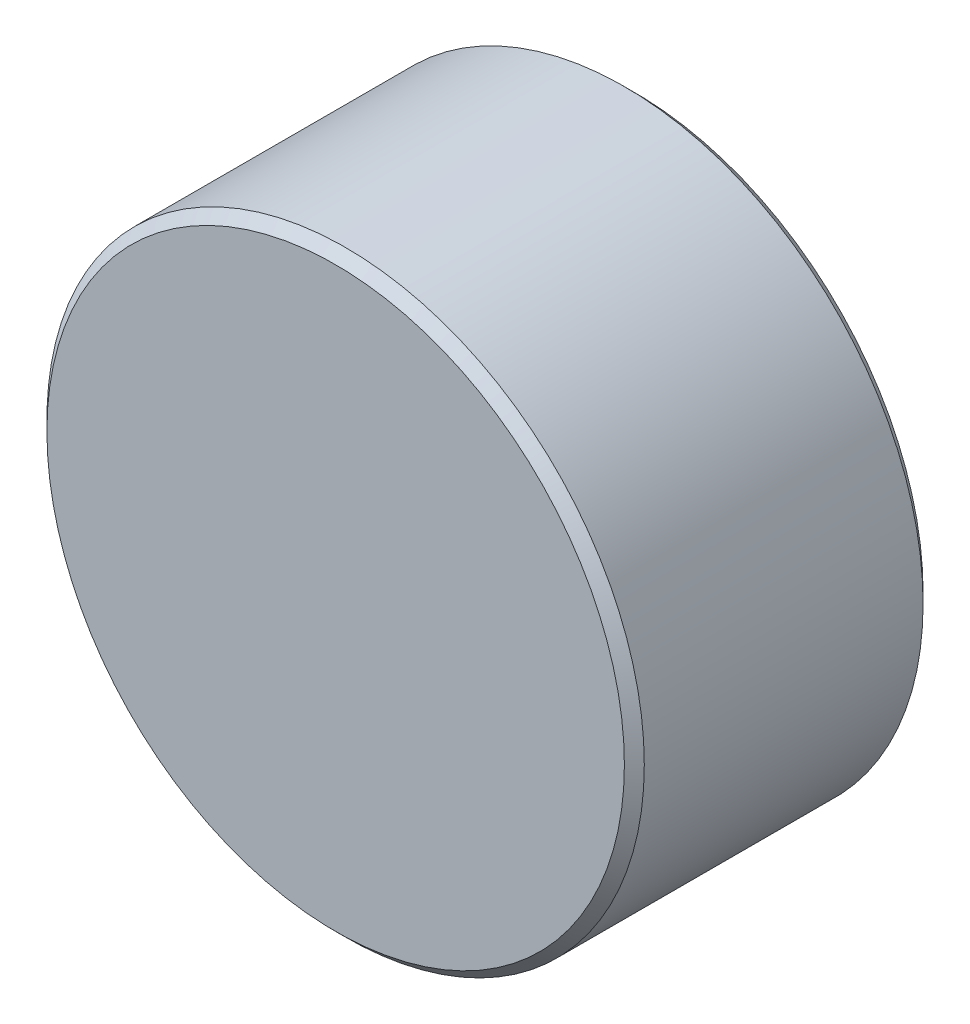
ISO-10303-21;
HEADER;
FILE_DESCRIPTION(('STEP AP214'),'2;1');
FILE_NAME('part.step','',(''),(''),'','','');
FILE_SCHEMA(('AUTOMOTIVE_DESIGN { 1 0 10303 214 1 1 1 1 }'));
ENDSEC;
DATA;
#1=APPLICATION_CONTEXT('core data for automotive mechanical design processes');
#2=APPLICATION_PROTOCOL_DEFINITION('international standard','automotive_design',2000,#1);
#3=PRODUCT_CONTEXT('',#1,'mechanical');
#4=PRODUCT('Part','Part','',(#3));
#5=PRODUCT_RELATED_PRODUCT_CATEGORY('part','',(#4));
#6=PRODUCT_DEFINITION_FORMATION('','',#4);
#7=PRODUCT_DEFINITION_CONTEXT('part definition',#1,'design');
#8=PRODUCT_DEFINITION('design','',#6,#7);
#9=PRODUCT_DEFINITION_SHAPE('','',#8);
#10=(LENGTH_UNIT() NAMED_UNIT(*) SI_UNIT(.MILLI.,.METRE.));
#11=(NAMED_UNIT(*) PLANE_ANGLE_UNIT() SI_UNIT($,.RADIAN.));
#12=(NAMED_UNIT(*) SI_UNIT($,.STERADIAN.) SOLID_ANGLE_UNIT());
#13=UNCERTAINTY_MEASURE_WITH_UNIT(LENGTH_MEASURE(1.E-05),#10,'distance_accuracy_value','');
#14=(GEOMETRIC_REPRESENTATION_CONTEXT(3) GLOBAL_UNCERTAINTY_ASSIGNED_CONTEXT((#13)) GLOBAL_UNIT_ASSIGNED_CONTEXT((#10,
#11,#12)) REPRESENTATION_CONTEXT('',''));
#15=CARTESIAN_POINT('',(0.,0.,0.));
#16=DIRECTION('',(0.,0.,1.));
#17=DIRECTION('',(1.,0.,0.));
#18=AXIS2_PLACEMENT_3D('',#15,#16,#17);
#19=CARTESIAN_POINT('',(0.,0.,3.));
#20=DIRECTION('',(0.,0.,-1.));
#21=DIRECTION('',(-1.,0.,0.));
#22=AXIS2_PLACEMENT_3D('',#19,#20,#21);
#23=CYLINDRICAL_SURFACE('',#22,3.);
#24=CARTESIAN_POINT('',(0.,0.,0.0999999999999981));
#25=DIRECTION('',(0.,0.,1.));
#26=DIRECTION('',(1.,0.,0.));
#27=AXIS2_PLACEMENT_3D('',#24,#25,#26);
#28=CIRCLE('',#27,3.);
#29=CARTESIAN_POINT('',(3.,0.,0.0999999999999981));
#30=VERTEX_POINT('',#29);
#31=EDGE_CURVE('E50',#30,#30,#28,.T.);
#32=ORIENTED_EDGE('',*,*,#31,.T.);
#33=EDGE_LOOP('',(#32));
#34=FACE_BOUND('',#33,.T.);
#35=CARTESIAN_POINT('',(0.,0.,2.9));
#36=DIRECTION('',(0.,0.,1.));
#37=DIRECTION('',(1.,0.,0.));
#38=AXIS2_PLACEMENT_3D('',#35,#36,#37);
#39=CIRCLE('',#38,3.);
#40=CARTESIAN_POINT('',(3.,0.,2.9));
#41=VERTEX_POINT('',#40);
#42=EDGE_CURVE('E55',#41,#41,#39,.F.);
#43=ORIENTED_EDGE('',*,*,#42,.T.);
#44=EDGE_LOOP('',(#43));
#45=FACE_BOUND('',#44,.T.);
#46=ADVANCED_FACE('F37',(#34,#45),#23,.T.);
#47=CARTESIAN_POINT('',(0.,0.,3.));
#48=DIRECTION('',(0.,0.,1.));
#49=DIRECTION('',(1.,0.,0.));
#50=AXIS2_PLACEMENT_3D('',#47,#48,#49);
#51=PLANE('',#50);
#52=CARTESIAN_POINT('',(0.,0.,3.));
#53=DIRECTION('',(0.,0.,1.));
#54=DIRECTION('',(1.,0.,0.));
#55=AXIS2_PLACEMENT_3D('',#52,#53,#54);
#56=CIRCLE('',#55,2.9);
#57=CARTESIAN_POINT('',(2.9,0.,3.));
#58=VERTEX_POINT('',#57);
#59=EDGE_CURVE('E10',#58,#58,#56,.T.);
#60=ORIENTED_EDGE('',*,*,#59,.T.);
#61=EDGE_LOOP('',(#60));
#62=FACE_BOUND('',#61,.T.);
#63=ADVANCED_FACE('F72',(#62),#51,.T.);
#64=CARTESIAN_POINT('',(0.,0.,0.));
#65=DIRECTION('',(0.,0.,1.));
#66=DIRECTION('',(1.,0.,0.));
#67=AXIS2_PLACEMENT_3D('',#64,#65,#66);
#68=PLANE('',#67);
#69=CARTESIAN_POINT('',(0.,0.,0.));
#70=DIRECTION('',(0.,0.,1.));
#71=DIRECTION('',(1.,0.,0.));
#72=AXIS2_PLACEMENT_3D('',#69,#70,#71);
#73=CIRCLE('',#72,2.9);
#74=CARTESIAN_POINT('',(2.9,0.,0.));
#75=VERTEX_POINT('',#74);
#76=EDGE_CURVE('E45',#75,#75,#73,.F.);
#77=ORIENTED_EDGE('',*,*,#76,.T.);
#78=EDGE_LOOP('',(#77));
#79=FACE_BOUND('',#78,.T.);
#80=ADVANCED_FACE('F69',(#79),#68,.F.);
#81=CARTESIAN_POINT('',(0.,0.,0.0999999999999981));
#82=DIRECTION('',(0.,0.,1.));
#83=DIRECTION('',(1.,0.,0.));
#84=AXIS2_PLACEMENT_3D('',#81,#82,#83);
#85=CONICAL_SURFACE('',#84,3.,0.785398163397448);
#86=ORIENTED_EDGE('',*,*,#76,.F.);
#87=EDGE_LOOP('',(#86));
#88=FACE_BOUND('',#87,.T.);
#89=ORIENTED_EDGE('',*,*,#31,.F.);
#90=EDGE_LOOP('',(#89));
#91=FACE_BOUND('',#90,.T.);
#92=ADVANCED_FACE('F65',(#88,#91),#85,.T.);
#93=CARTESIAN_POINT('',(0.,0.,3.));
#94=DIRECTION('',(0.,0.,-1.));
#95=DIRECTION('',(-1.,0.,0.));
#96=AXIS2_PLACEMENT_3D('',#93,#94,#95);
#97=CONICAL_SURFACE('',#96,2.9,0.78539816339745);
#98=ORIENTED_EDGE('',*,*,#42,.F.);
#99=EDGE_LOOP('',(#98));
#100=FACE_BOUND('',#99,.T.);
#101=ORIENTED_EDGE('',*,*,#59,.F.);
#102=EDGE_LOOP('',(#101));
#103=FACE_BOUND('',#102,.T.);
#104=ADVANCED_FACE('F39',(#100,#103),#97,.T.);
#105=CLOSED_SHELL('',(#46,#63,#80,#92,#104));
#106=MANIFOLD_SOLID_BREP('B2',#105);
#107=ADVANCED_BREP_SHAPE_REPRESENTATION('',(#18,#106),#14);
#108=SHAPE_DEFINITION_REPRESENTATION(#9,#107);
ENDSEC;
END-ISO-10303-21;
